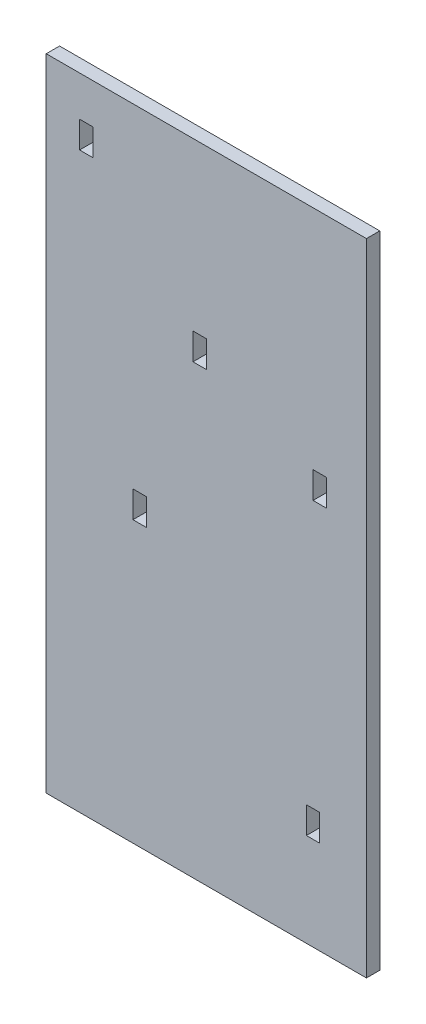
ISO-10303-21;
HEADER;
FILE_DESCRIPTION(('STEP AP214'),'2;1');
FILE_NAME('part.step','',(''),(''),'','','');
FILE_SCHEMA(('AUTOMOTIVE_DESIGN { 1 0 10303 214 1 1 1 1 }'));
ENDSEC;
DATA;
#1=APPLICATION_CONTEXT('core data for automotive mechanical design processes');
#2=APPLICATION_PROTOCOL_DEFINITION('international standard','automotive_design',2000,#1);
#3=PRODUCT_CONTEXT('',#1,'mechanical');
#4=PRODUCT('Part','Part','',(#3));
#5=PRODUCT_RELATED_PRODUCT_CATEGORY('part','',(#4));
#6=PRODUCT_DEFINITION_FORMATION('','',#4);
#7=PRODUCT_DEFINITION_CONTEXT('part definition',#1,'design');
#8=PRODUCT_DEFINITION('design','',#6,#7);
#9=PRODUCT_DEFINITION_SHAPE('','',#8);
#10=(LENGTH_UNIT() NAMED_UNIT(*) SI_UNIT(.MILLI.,.METRE.));
#11=(NAMED_UNIT(*) PLANE_ANGLE_UNIT() SI_UNIT($,.RADIAN.));
#12=(NAMED_UNIT(*) SI_UNIT($,.STERADIAN.) SOLID_ANGLE_UNIT());
#13=UNCERTAINTY_MEASURE_WITH_UNIT(LENGTH_MEASURE(1.E-05),#10,'distance_accuracy_value','');
#14=(GEOMETRIC_REPRESENTATION_CONTEXT(3) GLOBAL_UNCERTAINTY_ASSIGNED_CONTEXT((#13)) GLOBAL_UNIT_ASSIGNED_CONTEXT((#10,
#11,#12)) REPRESENTATION_CONTEXT('',''));
#15=CARTESIAN_POINT('',(0.,0.,0.));
#16=DIRECTION('',(0.,0.,1.));
#17=DIRECTION('',(1.,0.,0.));
#18=AXIS2_PLACEMENT_3D('',#15,#16,#17);
#19=CARTESIAN_POINT('',(0.,0.,12.7));
#20=DIRECTION('',(0.,0.,1.));
#21=DIRECTION('',(1.,0.,0.));
#22=AXIS2_PLACEMENT_3D('',#19,#20,#21);
#23=PLANE('',#22);
#24=DIRECTION('',(0.,-1.,0.));
#25=VECTOR('',#24,1.);
#26=CARTESIAN_POINT('',(-114.3,0.,12.7));
#27=LINE('',#26,#25);
#28=CARTESIAN_POINT('',(-114.3,-25.4000000000003,12.7));
#29=VERTEX_POINT('',#28);
#30=CARTESIAN_POINT('',(-114.3,-76.2000000000003,12.7));
#31=VERTEX_POINT('',#30);
#32=EDGE_CURVE('E314',#29,#31,#27,.T.);
#33=ORIENTED_EDGE('',*,*,#32,.T.);
#34=DIRECTION('',(-1.,0.,0.));
#35=VECTOR('',#34,1.);
#36=CARTESIAN_POINT('',(0.,-76.2000000000003,12.7));
#37=LINE('',#36,#35);
#38=CARTESIAN_POINT('',(-139.7,-76.2000000000003,12.7));
#39=VERTEX_POINT('',#38);
#40=EDGE_CURVE('E317',#31,#39,#37,.T.);
#41=ORIENTED_EDGE('',*,*,#40,.T.);
#42=DIRECTION('',(0.,-1.,0.));
#43=VECTOR('',#42,1.);
#44=CARTESIAN_POINT('',(-139.7,0.,12.7));
#45=LINE('',#44,#43);
#46=CARTESIAN_POINT('',(-139.7,-25.4000000000003,12.7));
#47=VERTEX_POINT('',#46);
#48=EDGE_CURVE('E321',#47,#39,#45,.T.);
#49=ORIENTED_EDGE('',*,*,#48,.F.);
#50=DIRECTION('',(-1.,0.,0.));
#51=VECTOR('',#50,1.);
#52=CARTESIAN_POINT('',(0.,-25.4000000000003,12.7));
#53=LINE('',#52,#51);
#54=EDGE_CURVE('E323',#29,#47,#53,.T.);
#55=ORIENTED_EDGE('',*,*,#54,.F.);
#56=EDGE_LOOP('',(#33,#41,#49,#55));
#57=FACE_BOUND('',#56,.T.);
#58=DIRECTION('',(0.,-1.,0.));
#59=VECTOR('',#58,1.);
#60=CARTESIAN_POINT('',(0.,0.,12.7));
#61=LINE('',#60,#59);
#62=CARTESIAN_POINT('',(1.23165366794353E-13,292.1,12.7));
#63=VERTEX_POINT('',#62);
#64=CARTESIAN_POINT('',(1.16944161054685E-13,241.3,12.7));
#65=VERTEX_POINT('',#64);
#66=EDGE_CURVE('E340',#63,#65,#61,.T.);
#67=ORIENTED_EDGE('',*,*,#66,.T.);
#68=DIRECTION('',(-1.,0.,0.));
#69=VECTOR('',#68,1.);
#70=CARTESIAN_POINT('',(0.,241.3,12.7));
#71=LINE('',#70,#69);
#72=CARTESIAN_POINT('',(-25.3999999999999,241.3,12.7));
#73=VERTEX_POINT('',#72);
#74=EDGE_CURVE('E343',#65,#73,#71,.T.);
#75=ORIENTED_EDGE('',*,*,#74,.T.);
#76=DIRECTION('',(0.,-1.,0.));
#77=VECTOR('',#76,1.);
#78=CARTESIAN_POINT('',(-25.3999999999999,0.,12.7));
#79=LINE('',#78,#77);
#80=CARTESIAN_POINT('',(-25.3999999999999,292.1,12.7));
#81=VERTEX_POINT('',#80);
#82=EDGE_CURVE('E347',#81,#73,#79,.T.);
#83=ORIENTED_EDGE('',*,*,#82,.F.);
#84=DIRECTION('',(-1.,0.,0.));
#85=VECTOR('',#84,1.);
#86=CARTESIAN_POINT('',(0.,292.1,12.7));
#87=LINE('',#86,#85);
#88=EDGE_CURVE('E350',#63,#81,#87,.T.);
#89=ORIENTED_EDGE('',*,*,#88,.F.);
#90=EDGE_LOOP('',(#67,#75,#83,#89));
#91=FACE_BOUND('',#90,.T.);
#92=DIRECTION('',(0.,-1.,0.));
#93=VECTOR('',#92,1.);
#94=CARTESIAN_POINT('',(-304.8,-609.6,12.7));
#95=LINE('',#94,#93);
#96=CARTESIAN_POINT('',(-304.8,609.6,12.7));
#97=VERTEX_POINT('',#96);
#98=CARTESIAN_POINT('',(-304.8,-609.6,12.7));
#99=VERTEX_POINT('',#98);
#100=EDGE_CURVE('E371',#97,#99,#95,.T.);
#101=ORIENTED_EDGE('',*,*,#100,.T.);
#102=DIRECTION('',(1.,0.,0.));
#103=VECTOR('',#102,1.);
#104=CARTESIAN_POINT('',(304.8,-609.6,12.7));
#105=LINE('',#104,#103);
#106=CARTESIAN_POINT('',(304.8,-609.6,12.7));
#107=VERTEX_POINT('',#106);
#108=EDGE_CURVE('E374',#99,#107,#105,.T.);
#109=ORIENTED_EDGE('',*,*,#108,.T.);
#110=DIRECTION('',(0.,1.,0.));
#111=VECTOR('',#110,1.);
#112=CARTESIAN_POINT('',(304.8,-609.6,12.7));
#113=LINE('',#112,#111);
#114=CARTESIAN_POINT('',(304.8,609.6,12.7));
#115=VERTEX_POINT('',#114);
#116=EDGE_CURVE('E377',#107,#115,#113,.T.);
#117=ORIENTED_EDGE('',*,*,#116,.T.);
#118=DIRECTION('',(-1.,0.,0.));
#119=VECTOR('',#118,1.);
#120=CARTESIAN_POINT('',(304.8,609.6,12.7));
#121=LINE('',#120,#119);
#122=EDGE_CURVE('E379',#115,#97,#121,.T.);
#123=ORIENTED_EDGE('',*,*,#122,.T.);
#124=EDGE_LOOP('',(#101,#109,#117,#123));
#125=FACE_BOUND('',#124,.T.);
#126=DIRECTION('',(-1.,0.,0.));
#127=VECTOR('',#126,1.);
#128=CARTESIAN_POINT('',(-9.43689570931383E-13,-431.8,12.7));
#129=LINE('',#128,#127);
#130=CARTESIAN_POINT('',(215.9,-431.8,12.7));
#131=VERTEX_POINT('',#130);
#132=CARTESIAN_POINT('',(190.5,-431.8,12.7));
#133=VERTEX_POINT('',#132);
#134=EDGE_CURVE('E261',#131,#133,#129,.T.);
#135=ORIENTED_EDGE('',*,*,#134,.T.);
#136=DIRECTION('',(0.,-1.,0.));
#137=VECTOR('',#136,1.);
#138=CARTESIAN_POINT('',(190.5,0.,12.7));
#139=LINE('',#138,#137);
#140=CARTESIAN_POINT('',(190.5,-381.,12.7));
#141=VERTEX_POINT('',#140);
#142=EDGE_CURVE('E253',#141,#133,#139,.T.);
#143=ORIENTED_EDGE('',*,*,#142,.F.);
#144=DIRECTION('',(-1.,0.,0.));
#145=VECTOR('',#144,1.);
#146=CARTESIAN_POINT('',(0.,-381.,12.7));
#147=LINE('',#146,#145);
#148=CARTESIAN_POINT('',(215.9,-381.,12.7));
#149=VERTEX_POINT('',#148);
#150=EDGE_CURVE('E255',#149,#141,#147,.T.);
#151=ORIENTED_EDGE('',*,*,#150,.F.);
#152=DIRECTION('',(0.,-1.,0.));
#153=VECTOR('',#152,1.);
#154=CARTESIAN_POINT('',(215.9,0.,12.7));
#155=LINE('',#154,#153);
#156=EDGE_CURVE('E258',#149,#131,#155,.T.);
#157=ORIENTED_EDGE('',*,*,#156,.T.);
#158=EDGE_LOOP('',(#135,#143,#151,#157));
#159=FACE_BOUND('',#158,.T.);
#160=DIRECTION('',(-1.,0.,0.));
#161=VECTOR('',#160,1.);
#162=CARTESIAN_POINT('',(0.,482.6,12.7));
#163=LINE('',#162,#161);
#164=CARTESIAN_POINT('',(-215.9,482.6,12.7));
#165=VERTEX_POINT('',#164);
#166=CARTESIAN_POINT('',(-241.3,482.6,12.7));
#167=VERTEX_POINT('',#166);
#168=EDGE_CURVE('E228',#165,#167,#163,.T.);
#169=ORIENTED_EDGE('',*,*,#168,.T.);
#170=DIRECTION('',(0.,-1.,0.));
#171=VECTOR('',#170,1.);
#172=CARTESIAN_POINT('',(-241.3,0.,12.7));
#173=LINE('',#172,#171);
#174=CARTESIAN_POINT('',(-241.3,533.4,12.7));
#175=VERTEX_POINT('',#174);
#176=EDGE_CURVE('E221',#175,#167,#173,.T.);
#177=ORIENTED_EDGE('',*,*,#176,.F.);
#178=DIRECTION('',(-1.,0.,0.));
#179=VECTOR('',#178,1.);
#180=CARTESIAN_POINT('',(0.,533.4,12.7));
#181=LINE('',#180,#179);
#182=CARTESIAN_POINT('',(-215.9,533.4,12.7));
#183=VERTEX_POINT('',#182);
#184=EDGE_CURVE('E210',#183,#175,#181,.T.);
#185=ORIENTED_EDGE('',*,*,#184,.F.);
#186=DIRECTION('',(0.,-1.,0.));
#187=VECTOR('',#186,1.);
#188=CARTESIAN_POINT('',(-215.9,0.,12.7));
#189=LINE('',#188,#187);
#190=EDGE_CURVE('E220',#183,#165,#189,.T.);
#191=ORIENTED_EDGE('',*,*,#190,.T.);
#192=EDGE_LOOP('',(#169,#177,#185,#191));
#193=FACE_BOUND('',#192,.T.);
#194=DIRECTION('',(-1.,0.,0.));
#195=VECTOR('',#194,1.);
#196=CARTESIAN_POINT('',(0.,127.,12.7));
#197=LINE('',#196,#195);
#198=CARTESIAN_POINT('',(228.6,127.,12.7));
#199=VERTEX_POINT('',#198);
#200=CARTESIAN_POINT('',(203.2,127.,12.7));
#201=VERTEX_POINT('',#200);
#202=EDGE_CURVE('E289',#199,#201,#197,.T.);
#203=ORIENTED_EDGE('',*,*,#202,.T.);
#204=DIRECTION('',(0.,-1.,0.));
#205=VECTOR('',#204,1.);
#206=CARTESIAN_POINT('',(203.2,0.,12.7));
#207=LINE('',#206,#205);
#208=CARTESIAN_POINT('',(203.2,177.8,12.7));
#209=VERTEX_POINT('',#208);
#210=EDGE_CURVE('E283',#209,#201,#207,.T.);
#211=ORIENTED_EDGE('',*,*,#210,.F.);
#212=DIRECTION('',(-1.,0.,0.));
#213=VECTOR('',#212,1.);
#214=CARTESIAN_POINT('',(0.,177.8,12.7));
#215=LINE('',#214,#213);
#216=CARTESIAN_POINT('',(228.6,177.8,12.7));
#217=VERTEX_POINT('',#216);
#218=EDGE_CURVE('E285',#217,#209,#215,.T.);
#219=ORIENTED_EDGE('',*,*,#218,.F.);
#220=DIRECTION('',(0.,-1.,0.));
#221=VECTOR('',#220,1.);
#222=CARTESIAN_POINT('',(228.6,0.,12.7));
#223=LINE('',#222,#221);
#224=EDGE_CURVE('E62',#217,#199,#223,.T.);
#225=ORIENTED_EDGE('',*,*,#224,.T.);
#226=EDGE_LOOP('',(#203,#211,#219,#225));
#227=FACE_BOUND('',#226,.T.);
#228=ADVANCED_FACE('F47',(#57,#91,#125,#159,#193,#227),#23,.T.);
#229=CARTESIAN_POINT('',(0.,0.,-12.7));
#230=DIRECTION('',(0.,0.,1.));
#231=DIRECTION('',(1.,0.,0.));
#232=AXIS2_PLACEMENT_3D('',#229,#230,#231);
#233=PLANE('',#232);
#234=DIRECTION('',(0.,-1.,0.));
#235=VECTOR('',#234,1.);
#236=CARTESIAN_POINT('',(-241.3,0.,-12.7));
#237=LINE('',#236,#235);
#238=CARTESIAN_POINT('',(-241.3,533.4,-12.7));
#239=VERTEX_POINT('',#238);
#240=CARTESIAN_POINT('',(-241.3,482.6,-12.7));
#241=VERTEX_POINT('',#240);
#242=EDGE_CURVE('E227',#239,#241,#237,.T.);
#243=ORIENTED_EDGE('',*,*,#242,.T.);
#244=DIRECTION('',(-1.,0.,0.));
#245=VECTOR('',#244,1.);
#246=CARTESIAN_POINT('',(0.,482.6,-12.7));
#247=LINE('',#246,#245);
#248=CARTESIAN_POINT('',(-215.9,482.6,-12.7));
#249=VERTEX_POINT('',#248);
#250=EDGE_CURVE('E233',#249,#241,#247,.T.);
#251=ORIENTED_EDGE('',*,*,#250,.F.);
#252=DIRECTION('',(0.,-1.,0.));
#253=VECTOR('',#252,1.);
#254=CARTESIAN_POINT('',(-215.9,0.,-12.7));
#255=LINE('',#254,#253);
#256=CARTESIAN_POINT('',(-215.9,533.4,-12.7));
#257=VERTEX_POINT('',#256);
#258=EDGE_CURVE('E236',#257,#249,#255,.T.);
#259=ORIENTED_EDGE('',*,*,#258,.F.);
#260=DIRECTION('',(-1.,0.,0.));
#261=VECTOR('',#260,1.);
#262=CARTESIAN_POINT('',(0.,533.4,-12.7));
#263=LINE('',#262,#261);
#264=EDGE_CURVE('E242',#257,#239,#263,.T.);
#265=ORIENTED_EDGE('',*,*,#264,.T.);
#266=EDGE_LOOP('',(#243,#251,#259,#265));
#267=FACE_BOUND('',#266,.T.);
#268=DIRECTION('',(0.,-1.,0.));
#269=VECTOR('',#268,1.);
#270=CARTESIAN_POINT('',(-304.8,-609.6,-12.7));
#271=LINE('',#270,#269);
#272=CARTESIAN_POINT('',(-304.8,609.6,-12.7));
#273=VERTEX_POINT('',#272);
#274=CARTESIAN_POINT('',(-304.8,-609.6,-12.7));
#275=VERTEX_POINT('',#274);
#276=EDGE_CURVE('E364',#273,#275,#271,.T.);
#277=ORIENTED_EDGE('',*,*,#276,.F.);
#278=DIRECTION('',(-1.,0.,0.));
#279=VECTOR('',#278,1.);
#280=CARTESIAN_POINT('',(304.8,609.6,-12.7));
#281=LINE('',#280,#279);
#282=CARTESIAN_POINT('',(304.8,609.6,-12.7));
#283=VERTEX_POINT('',#282);
#284=EDGE_CURVE('E375',#283,#273,#281,.T.);
#285=ORIENTED_EDGE('',*,*,#284,.F.);
#286=DIRECTION('',(0.,1.,0.));
#287=VECTOR('',#286,1.);
#288=CARTESIAN_POINT('',(304.8,-609.6,-12.7));
#289=LINE('',#288,#287);
#290=CARTESIAN_POINT('',(304.8,-609.6,-12.7));
#291=VERTEX_POINT('',#290);
#292=EDGE_CURVE('E386',#291,#283,#289,.T.);
#293=ORIENTED_EDGE('',*,*,#292,.F.);
#294=DIRECTION('',(1.,0.,0.));
#295=VECTOR('',#294,1.);
#296=CARTESIAN_POINT('',(304.8,-609.6,-12.7));
#297=LINE('',#296,#295);
#298=EDGE_CURVE('E384',#275,#291,#297,.T.);
#299=ORIENTED_EDGE('',*,*,#298,.F.);
#300=EDGE_LOOP('',(#277,#285,#293,#299));
#301=FACE_BOUND('',#300,.T.);
#302=DIRECTION('',(-1.,0.,0.));
#303=VECTOR('',#302,1.);
#304=CARTESIAN_POINT('',(0.,241.3,-12.7));
#305=LINE('',#304,#303);
#306=CARTESIAN_POINT('',(1.16944161259677E-13,241.3,-12.7));
#307=VERTEX_POINT('',#306);
#308=CARTESIAN_POINT('',(-25.3999999999999,241.3,-12.7));
#309=VERTEX_POINT('',#308);
#310=EDGE_CURVE('E354',#307,#309,#305,.T.);
#311=ORIENTED_EDGE('',*,*,#310,.F.);
#312=DIRECTION('',(0.,-1.,0.));
#313=VECTOR('',#312,1.);
#314=CARTESIAN_POINT('',(0.,0.,-12.7));
#315=LINE('',#314,#313);
#316=CARTESIAN_POINT('',(1.23165366794353E-13,292.1,-12.7));
#317=VERTEX_POINT('',#316);
#318=EDGE_CURVE('E307',#317,#307,#315,.T.);
#319=ORIENTED_EDGE('',*,*,#318,.F.);
#320=DIRECTION('',(-1.,0.,0.));
#321=VECTOR('',#320,1.);
#322=CARTESIAN_POINT('',(0.,292.1,-12.7));
#323=LINE('',#322,#321);
#324=CARTESIAN_POINT('',(-25.3999999999999,292.1,-12.7));
#325=VERTEX_POINT('',#324);
#326=EDGE_CURVE('E344',#317,#325,#323,.T.);
#327=ORIENTED_EDGE('',*,*,#326,.T.);
#328=DIRECTION('',(0.,-1.,0.));
#329=VECTOR('',#328,1.);
#330=CARTESIAN_POINT('',(-25.3999999999999,0.,-12.7));
#331=LINE('',#330,#329);
#332=EDGE_CURVE('E357',#325,#309,#331,.T.);
#333=ORIENTED_EDGE('',*,*,#332,.T.);
#334=EDGE_LOOP('',(#311,#319,#327,#333));
#335=FACE_BOUND('',#334,.T.);
#336=DIRECTION('',(0.,-1.,0.));
#337=VECTOR('',#336,1.);
#338=CARTESIAN_POINT('',(190.5,0.,-12.7));
#339=LINE('',#338,#337);
#340=CARTESIAN_POINT('',(190.5,-381.,-12.7));
#341=VERTEX_POINT('',#340);
#342=CARTESIAN_POINT('',(190.5,-431.8,-12.7));
#343=VERTEX_POINT('',#342);
#344=EDGE_CURVE('E265',#341,#343,#339,.T.);
#345=ORIENTED_EDGE('',*,*,#344,.T.);
#346=DIRECTION('',(-1.,0.,0.));
#347=VECTOR('',#346,1.);
#348=CARTESIAN_POINT('',(-9.43689570931383E-13,-431.8,-12.7));
#349=LINE('',#348,#347);
#350=CARTESIAN_POINT('',(215.9,-431.8,-12.7));
#351=VERTEX_POINT('',#350);
#352=EDGE_CURVE('E256',#351,#343,#349,.T.);
#353=ORIENTED_EDGE('',*,*,#352,.F.);
#354=DIRECTION('',(0.,-1.,0.));
#355=VECTOR('',#354,1.);
#356=CARTESIAN_POINT('',(215.9,0.,-12.7));
#357=LINE('',#356,#355);
#358=CARTESIAN_POINT('',(215.9,-381.,-12.7));
#359=VERTEX_POINT('',#358);
#360=EDGE_CURVE('E271',#359,#351,#357,.T.);
#361=ORIENTED_EDGE('',*,*,#360,.F.);
#362=DIRECTION('',(-1.,0.,0.));
#363=VECTOR('',#362,1.);
#364=CARTESIAN_POINT('',(0.,-381.,-12.7));
#365=LINE('',#364,#363);
#366=EDGE_CURVE('E268',#359,#341,#365,.T.);
#367=ORIENTED_EDGE('',*,*,#366,.T.);
#368=EDGE_LOOP('',(#345,#353,#361,#367));
#369=FACE_BOUND('',#368,.T.);
#370=DIRECTION('',(-1.,0.,0.));
#371=VECTOR('',#370,1.);
#372=CARTESIAN_POINT('',(0.,-76.2000000000003,-12.7));
#373=LINE('',#372,#371);
#374=CARTESIAN_POINT('',(-114.3,-76.2000000000003,-12.7));
#375=VERTEX_POINT('',#374);
#376=CARTESIAN_POINT('',(-139.7,-76.2000000000003,-12.7));
#377=VERTEX_POINT('',#376);
#378=EDGE_CURVE('E327',#375,#377,#373,.T.);
#379=ORIENTED_EDGE('',*,*,#378,.F.);
#380=DIRECTION('',(0.,-1.,0.));
#381=VECTOR('',#380,1.);
#382=CARTESIAN_POINT('',(-114.3,0.,-12.7));
#383=LINE('',#382,#381);
#384=CARTESIAN_POINT('',(-114.3,-25.4000000000003,-12.7));
#385=VERTEX_POINT('',#384);
#386=EDGE_CURVE('E249',#385,#375,#383,.T.);
#387=ORIENTED_EDGE('',*,*,#386,.F.);
#388=DIRECTION('',(-1.,0.,0.));
#389=VECTOR('',#388,1.);
#390=CARTESIAN_POINT('',(0.,-25.4000000000003,-12.7));
#391=LINE('',#390,#389);
#392=CARTESIAN_POINT('',(-139.7,-25.4000000000003,-12.7));
#393=VERTEX_POINT('',#392);
#394=EDGE_CURVE('E318',#385,#393,#391,.T.);
#395=ORIENTED_EDGE('',*,*,#394,.T.);
#396=DIRECTION('',(0.,-1.,0.));
#397=VECTOR('',#396,1.);
#398=CARTESIAN_POINT('',(-139.7,0.,-12.7));
#399=LINE('',#398,#397);
#400=EDGE_CURVE('E329',#393,#377,#399,.T.);
#401=ORIENTED_EDGE('',*,*,#400,.T.);
#402=EDGE_LOOP('',(#379,#387,#395,#401));
#403=FACE_BOUND('',#402,.T.);
#404=DIRECTION('',(0.,-1.,0.));
#405=VECTOR('',#404,1.);
#406=CARTESIAN_POINT('',(203.2,0.,-12.7));
#407=LINE('',#406,#405);
#408=CARTESIAN_POINT('',(203.2,177.8,-12.7));
#409=VERTEX_POINT('',#408);
#410=CARTESIAN_POINT('',(203.2,127.,-12.7));
#411=VERTEX_POINT('',#410);
#412=EDGE_CURVE('E293',#409,#411,#407,.T.);
#413=ORIENTED_EDGE('',*,*,#412,.T.);
#414=DIRECTION('',(-1.,0.,0.));
#415=VECTOR('',#414,1.);
#416=CARTESIAN_POINT('',(0.,127.,-12.7));
#417=LINE('',#416,#415);
#418=CARTESIAN_POINT('',(228.6,127.,-12.7));
#419=VERTEX_POINT('',#418);
#420=EDGE_CURVE('E286',#419,#411,#417,.T.);
#421=ORIENTED_EDGE('',*,*,#420,.F.);
#422=DIRECTION('',(0.,-1.,0.));
#423=VECTOR('',#422,1.);
#424=CARTESIAN_POINT('',(228.6,0.,-12.7));
#425=LINE('',#424,#423);
#426=CARTESIAN_POINT('',(228.6,177.8,-12.7));
#427=VERTEX_POINT('',#426);
#428=EDGE_CURVE('E300',#427,#419,#425,.T.);
#429=ORIENTED_EDGE('',*,*,#428,.F.);
#430=DIRECTION('',(-1.,0.,0.));
#431=VECTOR('',#430,1.);
#432=CARTESIAN_POINT('',(0.,177.8,-12.7));
#433=LINE('',#432,#431);
#434=EDGE_CURVE('E296',#427,#409,#433,.T.);
#435=ORIENTED_EDGE('',*,*,#434,.T.);
#436=EDGE_LOOP('',(#413,#421,#429,#435));
#437=FACE_BOUND('',#436,.T.);
#438=ADVANCED_FACE('F404',(#267,#301,#335,#369,#403,#437),#233,.F.);
#439=CARTESIAN_POINT('',(-304.8,-609.6,12.7));
#440=DIRECTION('',(1.,0.,0.));
#441=DIRECTION('',(0.,0.,-1.));
#442=AXIS2_PLACEMENT_3D('',#439,#440,#441);
#443=PLANE('',#442);
#444=ORIENTED_EDGE('',*,*,#276,.T.);
#445=DIRECTION('',(0.,0.,-1.));
#446=VECTOR('',#445,1.);
#447=CARTESIAN_POINT('',(-304.8,-609.6,12.7));
#448=LINE('',#447,#446);
#449=EDGE_CURVE('E11',#99,#275,#448,.T.);
#450=ORIENTED_EDGE('',*,*,#449,.F.);
#451=ORIENTED_EDGE('',*,*,#100,.F.);
#452=DIRECTION('',(0.,0.,-1.));
#453=VECTOR('',#452,1.);
#454=CARTESIAN_POINT('',(-304.8,609.6,12.7));
#455=LINE('',#454,#453);
#456=EDGE_CURVE('E381',#97,#273,#455,.T.);
#457=ORIENTED_EDGE('',*,*,#456,.T.);
#458=EDGE_LOOP('',(#444,#450,#451,#457));
#459=FACE_BOUND('',#458,.T.);
#460=ADVANCED_FACE('F49',(#459),#443,.F.);
#461=CARTESIAN_POINT('',(304.8,-609.6,12.7));
#462=DIRECTION('',(0.,1.,0.));
#463=DIRECTION('',(-1.,0.,0.));
#464=AXIS2_PLACEMENT_3D('',#461,#462,#463);
#465=PLANE('',#464);
#466=ORIENTED_EDGE('',*,*,#298,.T.);
#467=DIRECTION('',(0.,0.,-1.));
#468=VECTOR('',#467,1.);
#469=CARTESIAN_POINT('',(304.8,-609.6,12.7));
#470=LINE('',#469,#468);
#471=EDGE_CURVE('E55',#107,#291,#470,.T.);
#472=ORIENTED_EDGE('',*,*,#471,.F.);
#473=ORIENTED_EDGE('',*,*,#108,.F.);
#474=ORIENTED_EDGE('',*,*,#449,.T.);
#475=EDGE_LOOP('',(#466,#472,#473,#474));
#476=FACE_BOUND('',#475,.T.);
#477=ADVANCED_FACE('F415',(#476),#465,.F.);
#478=CARTESIAN_POINT('',(304.8,-609.6,12.7));
#479=DIRECTION('',(-1.,0.,0.));
#480=DIRECTION('',(0.,0.,1.));
#481=AXIS2_PLACEMENT_3D('',#478,#479,#480);
#482=PLANE('',#481);
#483=ORIENTED_EDGE('',*,*,#292,.T.);
#484=DIRECTION('',(0.,0.,-1.));
#485=VECTOR('',#484,1.);
#486=CARTESIAN_POINT('',(304.8,609.6,12.7));
#487=LINE('',#486,#485);
#488=EDGE_CURVE('E391',#115,#283,#487,.T.);
#489=ORIENTED_EDGE('',*,*,#488,.F.);
#490=ORIENTED_EDGE('',*,*,#116,.F.);
#491=ORIENTED_EDGE('',*,*,#471,.T.);
#492=EDGE_LOOP('',(#483,#489,#490,#491));
#493=FACE_BOUND('',#492,.T.);
#494=ADVANCED_FACE('F398',(#493),#482,.F.);
#495=CARTESIAN_POINT('',(304.8,609.6,12.7));
#496=DIRECTION('',(0.,-1.,0.));
#497=DIRECTION('',(1.,0.,0.));
#498=AXIS2_PLACEMENT_3D('',#495,#496,#497);
#499=PLANE('',#498);
#500=ORIENTED_EDGE('',*,*,#284,.T.);
#501=ORIENTED_EDGE('',*,*,#456,.F.);
#502=ORIENTED_EDGE('',*,*,#122,.F.);
#503=ORIENTED_EDGE('',*,*,#488,.T.);
#504=EDGE_LOOP('',(#500,#501,#502,#503));
#505=FACE_BOUND('',#504,.T.);
#506=ADVANCED_FACE('F408',(#505),#499,.F.);
#507=CARTESIAN_POINT('',(0.,0.,12.7));
#508=DIRECTION('',(1.,0.,0.));
#509=DIRECTION('',(0.,1.,0.));
#510=AXIS2_PLACEMENT_3D('',#507,#508,#509);
#511=PLANE('',#510);
#512=ORIENTED_EDGE('',*,*,#318,.T.);
#513=DIRECTION('',(0.,0.,-1.));
#514=VECTOR('',#513,1.);
#515=CARTESIAN_POINT('',(1.16944161054685E-13,241.3,12.7));
#516=LINE('',#515,#514);
#517=EDGE_CURVE('E352',#65,#307,#516,.T.);
#518=ORIENTED_EDGE('',*,*,#517,.F.);
#519=ORIENTED_EDGE('',*,*,#66,.F.);
#520=DIRECTION('',(0.,0.,-1.));
#521=VECTOR('',#520,1.);
#522=CARTESIAN_POINT('',(1.23165366794353E-13,292.1,12.7));
#523=LINE('',#522,#521);
#524=EDGE_CURVE('E362',#63,#317,#523,.T.);
#525=ORIENTED_EDGE('',*,*,#524,.T.);
#526=EDGE_LOOP('',(#512,#518,#519,#525));
#527=FACE_BOUND('',#526,.T.);
#528=ADVANCED_FACE('F433',(#527),#511,.F.);
#529=CARTESIAN_POINT('',(0.,292.1,12.7));
#530=DIRECTION('',(0.,-1.,0.));
#531=DIRECTION('',(0.,0.,-1.));
#532=AXIS2_PLACEMENT_3D('',#529,#530,#531);
#533=PLANE('',#532);
#534=ORIENTED_EDGE('',*,*,#326,.F.);
#535=ORIENTED_EDGE('',*,*,#524,.F.);
#536=ORIENTED_EDGE('',*,*,#88,.T.);
#537=DIRECTION('',(0.,0.,-1.));
#538=VECTOR('',#537,1.);
#539=CARTESIAN_POINT('',(-25.3999999999999,292.1,12.7));
#540=LINE('',#539,#538);
#541=EDGE_CURVE('E365',#81,#325,#540,.T.);
#542=ORIENTED_EDGE('',*,*,#541,.T.);
#543=EDGE_LOOP('',(#534,#535,#536,#542));
#544=FACE_BOUND('',#543,.T.);
#545=ADVANCED_FACE('F439',(#544),#533,.T.);
#546=CARTESIAN_POINT('',(-25.3999999999999,0.,12.7));
#547=DIRECTION('',(1.,0.,0.));
#548=DIRECTION('',(0.,1.,0.));
#549=AXIS2_PLACEMENT_3D('',#546,#547,#548);
#550=PLANE('',#549);
#551=ORIENTED_EDGE('',*,*,#332,.F.);
#552=ORIENTED_EDGE('',*,*,#541,.F.);
#553=ORIENTED_EDGE('',*,*,#82,.T.);
#554=DIRECTION('',(0.,0.,-1.));
#555=VECTOR('',#554,1.);
#556=CARTESIAN_POINT('',(-25.3999999999999,241.3,12.7));
#557=LINE('',#556,#555);
#558=EDGE_CURVE('E367',#73,#309,#557,.T.);
#559=ORIENTED_EDGE('',*,*,#558,.T.);
#560=EDGE_LOOP('',(#551,#552,#553,#559));
#561=FACE_BOUND('',#560,.T.);
#562=ADVANCED_FACE('F444',(#561),#550,.T.);
#563=CARTESIAN_POINT('',(0.,241.3,12.7));
#564=DIRECTION('',(0.,-1.,0.));
#565=DIRECTION('',(0.,0.,-1.));
#566=AXIS2_PLACEMENT_3D('',#563,#564,#565);
#567=PLANE('',#566);
#568=ORIENTED_EDGE('',*,*,#310,.T.);
#569=ORIENTED_EDGE('',*,*,#558,.F.);
#570=ORIENTED_EDGE('',*,*,#74,.F.);
#571=ORIENTED_EDGE('',*,*,#517,.T.);
#572=EDGE_LOOP('',(#568,#569,#570,#571));
#573=FACE_BOUND('',#572,.T.);
#574=ADVANCED_FACE('F453',(#573),#567,.F.);
#575=CARTESIAN_POINT('',(190.5,0.,12.7));
#576=DIRECTION('',(1.,0.,0.));
#577=DIRECTION('',(0.,0.,-1.));
#578=AXIS2_PLACEMENT_3D('',#575,#576,#577);
#579=PLANE('',#578);
#580=ORIENTED_EDGE('',*,*,#344,.F.);
#581=DIRECTION('',(0.,0.,-1.));
#582=VECTOR('',#581,1.);
#583=CARTESIAN_POINT('',(190.5,-381.,12.7));
#584=LINE('',#583,#582);
#585=EDGE_CURVE('E264',#141,#341,#584,.T.);
#586=ORIENTED_EDGE('',*,*,#585,.F.);
#587=ORIENTED_EDGE('',*,*,#142,.T.);
#588=DIRECTION('',(0.,0.,-1.));
#589=VECTOR('',#588,1.);
#590=CARTESIAN_POINT('',(190.5,-431.8,12.7));
#591=LINE('',#590,#589);
#592=EDGE_CURVE('E243',#133,#343,#591,.T.);
#593=ORIENTED_EDGE('',*,*,#592,.T.);
#594=EDGE_LOOP('',(#580,#586,#587,#593));
#595=FACE_BOUND('',#594,.T.);
#596=ADVANCED_FACE('F465',(#595),#579,.T.);
#597=CARTESIAN_POINT('',(-9.43689570931383E-13,-431.8,12.7));
#598=DIRECTION('',(0.,-1.,0.));
#599=DIRECTION('',(1.,0.,0.));
#600=AXIS2_PLACEMENT_3D('',#597,#598,#599);
#601=PLANE('',#600);
#602=ORIENTED_EDGE('',*,*,#352,.T.);
#603=ORIENTED_EDGE('',*,*,#592,.F.);
#604=ORIENTED_EDGE('',*,*,#134,.F.);
#605=DIRECTION('',(0.,0.,-1.));
#606=VECTOR('',#605,1.);
#607=CARTESIAN_POINT('',(215.9,-431.8,12.7));
#608=LINE('',#607,#606);
#609=EDGE_CURVE('E277',#131,#351,#608,.T.);
#610=ORIENTED_EDGE('',*,*,#609,.T.);
#611=EDGE_LOOP('',(#602,#603,#604,#610));
#612=FACE_BOUND('',#611,.T.);
#613=ADVANCED_FACE('F499',(#612),#601,.F.);
#614=CARTESIAN_POINT('',(215.9,0.,12.7));
#615=DIRECTION('',(1.,0.,0.));
#616=DIRECTION('',(0.,0.,-1.));
#617=AXIS2_PLACEMENT_3D('',#614,#615,#616);
#618=PLANE('',#617);
#619=ORIENTED_EDGE('',*,*,#360,.T.);
#620=ORIENTED_EDGE('',*,*,#609,.F.);
#621=ORIENTED_EDGE('',*,*,#156,.F.);
#622=DIRECTION('',(0.,0.,-1.));
#623=VECTOR('',#622,1.);
#624=CARTESIAN_POINT('',(215.9,-381.,12.7));
#625=LINE('',#624,#623);
#626=EDGE_CURVE('E279',#149,#359,#625,.T.);
#627=ORIENTED_EDGE('',*,*,#626,.T.);
#628=EDGE_LOOP('',(#619,#620,#621,#627));
#629=FACE_BOUND('',#628,.T.);
#630=ADVANCED_FACE('F504',(#629),#618,.F.);
#631=CARTESIAN_POINT('',(0.,-381.,12.7));
#632=DIRECTION('',(0.,-1.,0.));
#633=DIRECTION('',(0.,0.,-1.));
#634=AXIS2_PLACEMENT_3D('',#631,#632,#633);
#635=PLANE('',#634);
#636=ORIENTED_EDGE('',*,*,#366,.F.);
#637=ORIENTED_EDGE('',*,*,#626,.F.);
#638=ORIENTED_EDGE('',*,*,#150,.T.);
#639=ORIENTED_EDGE('',*,*,#585,.T.);
#640=EDGE_LOOP('',(#636,#637,#638,#639));
#641=FACE_BOUND('',#640,.T.);
#642=ADVANCED_FACE('F501',(#641),#635,.T.);
#643=CARTESIAN_POINT('',(-241.3,0.,12.7));
#644=DIRECTION('',(1.,0.,0.));
#645=DIRECTION('',(0.,0.,-1.));
#646=AXIS2_PLACEMENT_3D('',#643,#644,#645);
#647=PLANE('',#646);
#648=ORIENTED_EDGE('',*,*,#242,.F.);
#649=DIRECTION('',(0.,0.,-1.));
#650=VECTOR('',#649,1.);
#651=CARTESIAN_POINT('',(-241.3,533.4,12.7));
#652=LINE('',#651,#650);
#653=EDGE_CURVE('E214',#175,#239,#652,.T.);
#654=ORIENTED_EDGE('',*,*,#653,.F.);
#655=ORIENTED_EDGE('',*,*,#176,.T.);
#656=DIRECTION('',(0.,0.,-1.));
#657=VECTOR('',#656,1.);
#658=CARTESIAN_POINT('',(-241.3,482.6,12.7));
#659=LINE('',#658,#657);
#660=EDGE_CURVE('E247',#167,#241,#659,.T.);
#661=ORIENTED_EDGE('',*,*,#660,.T.);
#662=EDGE_LOOP('',(#648,#654,#655,#661));
#663=FACE_BOUND('',#662,.T.);
#664=ADVANCED_FACE('F224',(#663),#647,.T.);
#665=CARTESIAN_POINT('',(0.,482.6,12.7));
#666=DIRECTION('',(0.,-1.,0.));
#667=DIRECTION('',(0.,0.,-1.));
#668=AXIS2_PLACEMENT_3D('',#665,#666,#667);
#669=PLANE('',#668);
#670=ORIENTED_EDGE('',*,*,#250,.T.);
#671=ORIENTED_EDGE('',*,*,#660,.F.);
#672=ORIENTED_EDGE('',*,*,#168,.F.);
#673=DIRECTION('',(0.,0.,-1.));
#674=VECTOR('',#673,1.);
#675=CARTESIAN_POINT('',(-215.9,482.6,12.7));
#676=LINE('',#675,#674);
#677=EDGE_CURVE('E250',#165,#249,#676,.T.);
#678=ORIENTED_EDGE('',*,*,#677,.T.);
#679=EDGE_LOOP('',(#670,#671,#672,#678));
#680=FACE_BOUND('',#679,.T.);
#681=ADVANCED_FACE('F514',(#680),#669,.F.);
#682=CARTESIAN_POINT('',(-215.9,0.,12.7));
#683=DIRECTION('',(1.,0.,0.));
#684=DIRECTION('',(0.,0.,-1.));
#685=AXIS2_PLACEMENT_3D('',#682,#683,#684);
#686=PLANE('',#685);
#687=ORIENTED_EDGE('',*,*,#258,.T.);
#688=ORIENTED_EDGE('',*,*,#677,.F.);
#689=ORIENTED_EDGE('',*,*,#190,.F.);
#690=DIRECTION('',(0.,0.,-1.));
#691=VECTOR('',#690,1.);
#692=CARTESIAN_POINT('',(-215.9,533.4,12.7));
#693=LINE('',#692,#691);
#694=EDGE_CURVE('E216',#183,#257,#693,.T.);
#695=ORIENTED_EDGE('',*,*,#694,.T.);
#696=EDGE_LOOP('',(#687,#688,#689,#695));
#697=FACE_BOUND('',#696,.T.);
#698=ADVANCED_FACE('F517',(#697),#686,.F.);
#699=CARTESIAN_POINT('',(0.,533.4,12.7));
#700=DIRECTION('',(0.,-1.,0.));
#701=DIRECTION('',(0.,0.,-1.));
#702=AXIS2_PLACEMENT_3D('',#699,#700,#701);
#703=PLANE('',#702);
#704=ORIENTED_EDGE('',*,*,#264,.F.);
#705=ORIENTED_EDGE('',*,*,#694,.F.);
#706=ORIENTED_EDGE('',*,*,#184,.T.);
#707=ORIENTED_EDGE('',*,*,#653,.T.);
#708=EDGE_LOOP('',(#704,#705,#706,#707));
#709=FACE_BOUND('',#708,.T.);
#710=ADVANCED_FACE('F213',(#709),#703,.T.);
#711=CARTESIAN_POINT('',(-114.3,0.,12.7));
#712=DIRECTION('',(1.,0.,0.));
#713=DIRECTION('',(0.,1.,0.));
#714=AXIS2_PLACEMENT_3D('',#711,#712,#713);
#715=PLANE('',#714);
#716=ORIENTED_EDGE('',*,*,#386,.T.);
#717=DIRECTION('',(0.,0.,-1.));
#718=VECTOR('',#717,1.);
#719=CARTESIAN_POINT('',(-114.3,-76.2000000000003,12.7));
#720=LINE('',#719,#718);
#721=EDGE_CURVE('E325',#31,#375,#720,.T.);
#722=ORIENTED_EDGE('',*,*,#721,.F.);
#723=ORIENTED_EDGE('',*,*,#32,.F.);
#724=DIRECTION('',(0.,0.,-1.));
#725=VECTOR('',#724,1.);
#726=CARTESIAN_POINT('',(-114.3,-25.4000000000003,12.7));
#727=LINE('',#726,#725);
#728=EDGE_CURVE('E297',#29,#385,#727,.T.);
#729=ORIENTED_EDGE('',*,*,#728,.T.);
#730=EDGE_LOOP('',(#716,#722,#723,#729));
#731=FACE_BOUND('',#730,.T.);
#732=ADVANCED_FACE('F467',(#731),#715,.F.);
#733=CARTESIAN_POINT('',(0.,-25.4000000000003,12.7));
#734=DIRECTION('',(0.,-1.,0.));
#735=DIRECTION('',(0.,0.,-1.));
#736=AXIS2_PLACEMENT_3D('',#733,#734,#735);
#737=PLANE('',#736);
#738=ORIENTED_EDGE('',*,*,#394,.F.);
#739=ORIENTED_EDGE('',*,*,#728,.F.);
#740=ORIENTED_EDGE('',*,*,#54,.T.);
#741=DIRECTION('',(0.,0.,-1.));
#742=VECTOR('',#741,1.);
#743=CARTESIAN_POINT('',(-139.7,-25.4000000000003,12.7));
#744=LINE('',#743,#742);
#745=EDGE_CURVE('E335',#47,#393,#744,.T.);
#746=ORIENTED_EDGE('',*,*,#745,.T.);
#747=EDGE_LOOP('',(#738,#739,#740,#746));
#748=FACE_BOUND('',#747,.T.);
#749=ADVANCED_FACE('F470',(#748),#737,.T.);
#750=CARTESIAN_POINT('',(-139.7,0.,12.7));
#751=DIRECTION('',(1.,0.,0.));
#752=DIRECTION('',(0.,0.,-1.));
#753=AXIS2_PLACEMENT_3D('',#750,#751,#752);
#754=PLANE('',#753);
#755=ORIENTED_EDGE('',*,*,#400,.F.);
#756=ORIENTED_EDGE('',*,*,#745,.F.);
#757=ORIENTED_EDGE('',*,*,#48,.T.);
#758=DIRECTION('',(0.,0.,-1.));
#759=VECTOR('',#758,1.);
#760=CARTESIAN_POINT('',(-139.7,-76.2000000000003,12.7));
#761=LINE('',#760,#759);
#762=EDGE_CURVE('E70',#39,#377,#761,.T.);
#763=ORIENTED_EDGE('',*,*,#762,.T.);
#764=EDGE_LOOP('',(#755,#756,#757,#763));
#765=FACE_BOUND('',#764,.T.);
#766=ADVANCED_FACE('F476',(#765),#754,.T.);
#767=CARTESIAN_POINT('',(0.,-76.2000000000003,12.7));
#768=DIRECTION('',(0.,-1.,0.));
#769=DIRECTION('',(0.,0.,-1.));
#770=AXIS2_PLACEMENT_3D('',#767,#768,#769);
#771=PLANE('',#770);
#772=ORIENTED_EDGE('',*,*,#378,.T.);
#773=ORIENTED_EDGE('',*,*,#762,.F.);
#774=ORIENTED_EDGE('',*,*,#40,.F.);
#775=ORIENTED_EDGE('',*,*,#721,.T.);
#776=EDGE_LOOP('',(#772,#773,#774,#775));
#777=FACE_BOUND('',#776,.T.);
#778=ADVANCED_FACE('F472',(#777),#771,.F.);
#779=CARTESIAN_POINT('',(203.2,0.,12.7));
#780=DIRECTION('',(1.,0.,0.));
#781=DIRECTION('',(0.,0.,-1.));
#782=AXIS2_PLACEMENT_3D('',#779,#780,#781);
#783=PLANE('',#782);
#784=ORIENTED_EDGE('',*,*,#412,.F.);
#785=DIRECTION('',(0.,0.,-1.));
#786=VECTOR('',#785,1.);
#787=CARTESIAN_POINT('',(203.2,177.8,12.7));
#788=LINE('',#787,#786);
#789=EDGE_CURVE('E292',#209,#409,#788,.T.);
#790=ORIENTED_EDGE('',*,*,#789,.F.);
#791=ORIENTED_EDGE('',*,*,#210,.T.);
#792=DIRECTION('',(0.,0.,-1.));
#793=VECTOR('',#792,1.);
#794=CARTESIAN_POINT('',(203.2,127.,12.7));
#795=LINE('',#794,#793);
#796=EDGE_CURVE('E305',#201,#411,#795,.T.);
#797=ORIENTED_EDGE('',*,*,#796,.T.);
#798=EDGE_LOOP('',(#784,#790,#791,#797));
#799=FACE_BOUND('',#798,.T.);
#800=ADVANCED_FACE('F475',(#799),#783,.T.);
#801=CARTESIAN_POINT('',(0.,127.,12.7));
#802=DIRECTION('',(0.,-1.,0.));
#803=DIRECTION('',(0.,0.,-1.));
#804=AXIS2_PLACEMENT_3D('',#801,#802,#803);
#805=PLANE('',#804);
#806=ORIENTED_EDGE('',*,*,#420,.T.);
#807=ORIENTED_EDGE('',*,*,#796,.F.);
#808=ORIENTED_EDGE('',*,*,#202,.F.);
#809=DIRECTION('',(0.,0.,-1.));
#810=VECTOR('',#809,1.);
#811=CARTESIAN_POINT('',(228.6,127.,12.7));
#812=LINE('',#811,#810);
#813=EDGE_CURVE('E308',#199,#419,#812,.T.);
#814=ORIENTED_EDGE('',*,*,#813,.T.);
#815=EDGE_LOOP('',(#806,#807,#808,#814));
#816=FACE_BOUND('',#815,.T.);
#817=ADVANCED_FACE('F485',(#816),#805,.F.);
#818=CARTESIAN_POINT('',(228.6,0.,12.7));
#819=DIRECTION('',(1.,0.,0.));
#820=DIRECTION('',(0.,0.,-1.));
#821=AXIS2_PLACEMENT_3D('',#818,#819,#820);
#822=PLANE('',#821);
#823=ORIENTED_EDGE('',*,*,#428,.T.);
#824=ORIENTED_EDGE('',*,*,#813,.F.);
#825=ORIENTED_EDGE('',*,*,#224,.F.);
#826=DIRECTION('',(0.,0.,-1.));
#827=VECTOR('',#826,1.);
#828=CARTESIAN_POINT('',(228.6,177.8,12.7));
#829=LINE('',#828,#827);
#830=EDGE_CURVE('E310',#217,#427,#829,.T.);
#831=ORIENTED_EDGE('',*,*,#830,.T.);
#832=EDGE_LOOP('',(#823,#824,#825,#831));
#833=FACE_BOUND('',#832,.T.);
#834=ADVANCED_FACE('F490',(#833),#822,.F.);
#835=CARTESIAN_POINT('',(0.,177.8,12.7));
#836=DIRECTION('',(0.,-1.,0.));
#837=DIRECTION('',(0.,0.,-1.));
#838=AXIS2_PLACEMENT_3D('',#835,#836,#837);
#839=PLANE('',#838);
#840=ORIENTED_EDGE('',*,*,#434,.F.);
#841=ORIENTED_EDGE('',*,*,#830,.F.);
#842=ORIENTED_EDGE('',*,*,#218,.T.);
#843=ORIENTED_EDGE('',*,*,#789,.T.);
#844=EDGE_LOOP('',(#840,#841,#842,#843));
#845=FACE_BOUND('',#844,.T.);
#846=ADVANCED_FACE('F487',(#845),#839,.T.);
#847=CLOSED_SHELL('',(#228,#438,#460,#477,#494,#506,#528,#545,#562,#574,#596,#613,#630,#642,
#664,#681,#698,#710,#732,#749,#766,#778,#800,#817,#834,#846));
#848=MANIFOLD_SOLID_BREP('B2',#847);
#849=ADVANCED_BREP_SHAPE_REPRESENTATION('',(#18,#848),#14);
#850=SHAPE_DEFINITION_REPRESENTATION(#9,#849);
ENDSEC;
END-ISO-10303-21;
